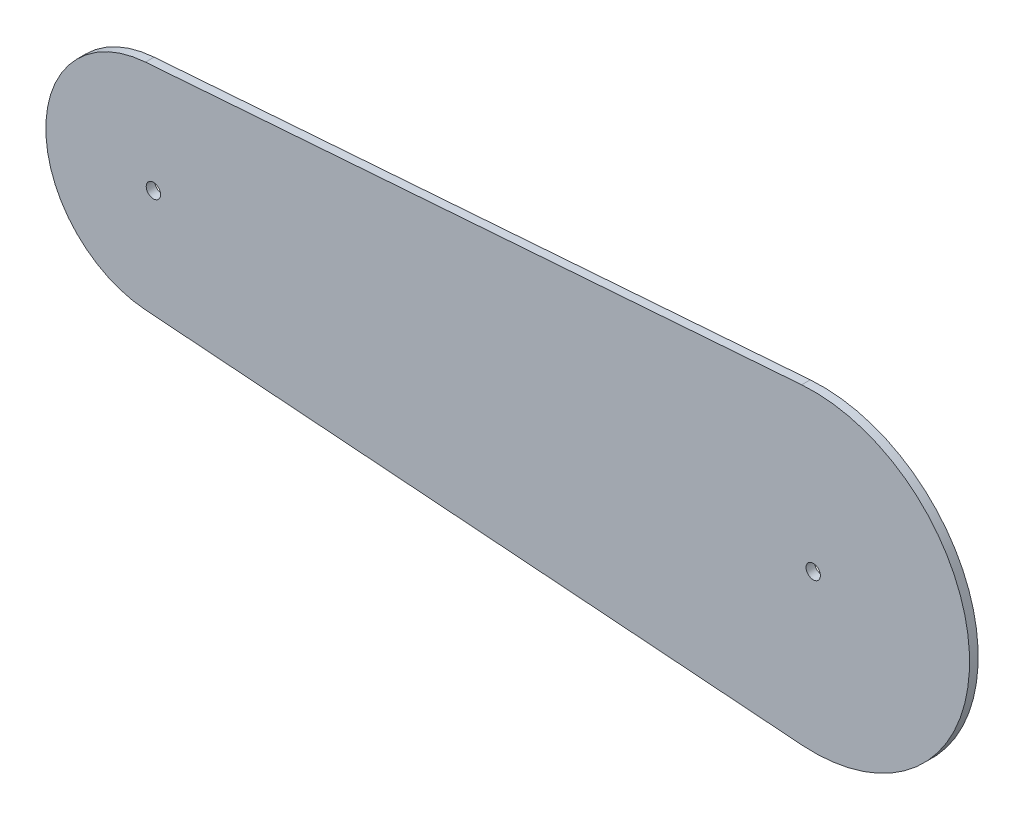
ISO-10303-21;
HEADER;
FILE_DESCRIPTION(('STEP AP214'),'2;1');
FILE_NAME('part.step','',(''),(''),'','','');
FILE_SCHEMA(('AUTOMOTIVE_DESIGN { 1 0 10303 214 1 1 1 1 }'));
ENDSEC;
DATA;
#1=APPLICATION_CONTEXT('core data for automotive mechanical design processes');
#2=APPLICATION_PROTOCOL_DEFINITION('international standard','automotive_design',2000,#1);
#3=PRODUCT_CONTEXT('',#1,'mechanical');
#4=PRODUCT('Part','Part','',(#3));
#5=PRODUCT_RELATED_PRODUCT_CATEGORY('part','',(#4));
#6=PRODUCT_DEFINITION_FORMATION('','',#4);
#7=PRODUCT_DEFINITION_CONTEXT('part definition',#1,'design');
#8=PRODUCT_DEFINITION('design','',#6,#7);
#9=PRODUCT_DEFINITION_SHAPE('','',#8);
#10=(LENGTH_UNIT() NAMED_UNIT(*) SI_UNIT(.MILLI.,.METRE.));
#11=(NAMED_UNIT(*) PLANE_ANGLE_UNIT() SI_UNIT($,.RADIAN.));
#12=(NAMED_UNIT(*) SI_UNIT($,.STERADIAN.) SOLID_ANGLE_UNIT());
#13=UNCERTAINTY_MEASURE_WITH_UNIT(LENGTH_MEASURE(1.E-05),#10,'distance_accuracy_value','');
#14=(GEOMETRIC_REPRESENTATION_CONTEXT(3) GLOBAL_UNCERTAINTY_ASSIGNED_CONTEXT((#13)) GLOBAL_UNIT_ASSIGNED_CONTEXT((#10,
#11,#12)) REPRESENTATION_CONTEXT('',''));
#15=CARTESIAN_POINT('',(0.,0.,0.));
#16=DIRECTION('',(0.,0.,1.));
#17=DIRECTION('',(1.,0.,0.));
#18=AXIS2_PLACEMENT_3D('',#15,#16,#17);
#19=CARTESIAN_POINT('',(0.,0.,3.));
#20=DIRECTION('',(0.,0.,-1.));
#21=DIRECTION('',(-1.,0.,0.));
#22=AXIS2_PLACEMENT_3D('',#19,#20,#21);
#23=CYLINDRICAL_SURFACE('',#22,37.5);
#24=CARTESIAN_POINT('',(0.,0.,0.));
#25=DIRECTION('',(0.,0.,1.));
#26=DIRECTION('',(1.,0.,0.));
#27=AXIS2_PLACEMENT_3D('',#24,#25,#26);
#28=CIRCLE('',#27,37.5);
#29=CARTESIAN_POINT('',(-2.77173913043479,37.3974258765602,0.));
#30=VERTEX_POINT('',#29);
#31=CARTESIAN_POINT('',(-2.77173913043478,-37.3974258765603,0.));
#32=VERTEX_POINT('',#31);
#33=EDGE_CURVE('E107',#30,#32,#28,.T.);
#34=ORIENTED_EDGE('',*,*,#33,.T.);
#35=DIRECTION('',(0.,0.,-1.));
#36=VECTOR('',#35,1.);
#37=CARTESIAN_POINT('',(-2.77173913043478,-37.3974258765603,3.));
#38=LINE('',#37,#36);
#39=CARTESIAN_POINT('',(-2.77173913043478,-37.3974258765603,3.));
#40=VERTEX_POINT('',#39);
#41=EDGE_CURVE('E11',#40,#32,#38,.T.);
#42=ORIENTED_EDGE('',*,*,#41,.F.);
#43=CARTESIAN_POINT('',(0.,0.,3.));
#44=DIRECTION('',(0.,0.,1.));
#45=DIRECTION('',(1.,0.,0.));
#46=AXIS2_PLACEMENT_3D('',#43,#44,#45);
#47=CIRCLE('',#46,37.5);
#48=CARTESIAN_POINT('',(-2.77173913043479,37.3974258765602,3.));
#49=VERTEX_POINT('',#48);
#50=EDGE_CURVE('E87',#49,#40,#47,.T.);
#51=ORIENTED_EDGE('',*,*,#50,.F.);
#52=DIRECTION('',(0.,0.,-1.));
#53=VECTOR('',#52,1.);
#54=CARTESIAN_POINT('',(-2.77173913043479,37.3974258765602,3.));
#55=LINE('',#54,#53);
#56=EDGE_CURVE('E53',#49,#30,#55,.T.);
#57=ORIENTED_EDGE('',*,*,#56,.T.);
#58=EDGE_LOOP('',(#34,#42,#51,#57));
#59=FACE_BOUND('',#58,.T.);
#60=ADVANCED_FACE('F36',(#59),#23,.T.);
#61=CARTESIAN_POINT('',(-2.77173913043478,-37.3974258765603,3.));
#62=DIRECTION('',(0.0739130434782608,0.997264690041606,0.));
#63=DIRECTION('',(-0.997264690041606,0.0739130434782608,0.));
#64=AXIS2_PLACEMENT_3D('',#61,#62,#63);
#65=PLANE('',#64);
#66=DIRECTION('',(0.997264690041606,-0.0739130434782608,0.));
#67=VECTOR('',#66,1.);
#68=CARTESIAN_POINT('',(-2.77173913043478,-37.3974258765603,0.));
#69=LINE('',#68,#67);
#70=CARTESIAN_POINT('',(225.971739130435,-54.3509256072675,0.));
#71=VERTEX_POINT('',#70);
#72=EDGE_CURVE('E92',#32,#71,#69,.T.);
#73=ORIENTED_EDGE('',*,*,#72,.T.);
#74=DIRECTION('',(0.,0.,-1.));
#75=VECTOR('',#74,1.);
#76=CARTESIAN_POINT('',(225.971739130435,-54.3509256072675,3.));
#77=LINE('',#76,#75);
#78=CARTESIAN_POINT('',(225.971739130435,-54.3509256072675,3.));
#79=VERTEX_POINT('',#78);
#80=EDGE_CURVE('E45',#79,#71,#77,.T.);
#81=ORIENTED_EDGE('',*,*,#80,.F.);
#82=DIRECTION('',(0.997264690041606,-0.0739130434782608,0.));
#83=VECTOR('',#82,1.);
#84=CARTESIAN_POINT('',(-2.77173913043478,-37.3974258765603,3.));
#85=LINE('',#84,#83);
#86=EDGE_CURVE('E79',#40,#79,#85,.T.);
#87=ORIENTED_EDGE('',*,*,#86,.F.);
#88=ORIENTED_EDGE('',*,*,#41,.T.);
#89=EDGE_LOOP('',(#73,#81,#87,#88));
#90=FACE_BOUND('',#89,.T.);
#91=ADVANCED_FACE('F91',(#90),#65,.F.);
#92=CARTESIAN_POINT('',(230.,0.,3.));
#93=DIRECTION('',(0.,0.,-1.));
#94=DIRECTION('',(-1.,0.,0.));
#95=AXIS2_PLACEMENT_3D('',#92,#93,#94);
#96=CYLINDRICAL_SURFACE('',#95,54.5);
#97=CARTESIAN_POINT('',(230.,0.,0.));
#98=DIRECTION('',(0.,0.,1.));
#99=DIRECTION('',(1.,0.,0.));
#100=AXIS2_PLACEMENT_3D('',#97,#98,#99);
#101=CIRCLE('',#100,54.5);
#102=CARTESIAN_POINT('',(225.971739130435,54.3509256072675,0.));
#103=VERTEX_POINT('',#102);
#104=EDGE_CURVE('E110',#71,#103,#101,.T.);
#105=ORIENTED_EDGE('',*,*,#104,.T.);
#106=DIRECTION('',(0.,0.,-1.));
#107=VECTOR('',#106,1.);
#108=CARTESIAN_POINT('',(225.971739130435,54.3509256072675,3.));
#109=LINE('',#108,#107);
#110=CARTESIAN_POINT('',(225.971739130435,54.3509256072675,3.));
#111=VERTEX_POINT('',#110);
#112=EDGE_CURVE('E68',#111,#103,#109,.T.);
#113=ORIENTED_EDGE('',*,*,#112,.F.);
#114=CARTESIAN_POINT('',(230.,0.,3.));
#115=DIRECTION('',(0.,0.,1.));
#116=DIRECTION('',(1.,0.,0.));
#117=AXIS2_PLACEMENT_3D('',#114,#115,#116);
#118=CIRCLE('',#117,54.5);
#119=EDGE_CURVE('E86',#79,#111,#118,.T.);
#120=ORIENTED_EDGE('',*,*,#119,.F.);
#121=ORIENTED_EDGE('',*,*,#80,.T.);
#122=EDGE_LOOP('',(#105,#113,#120,#121));
#123=FACE_BOUND('',#122,.T.);
#124=ADVANCED_FACE('F95',(#123),#96,.T.);
#125=CARTESIAN_POINT('',(-2.77173913043479,37.3974258765602,3.));
#126=DIRECTION('',(-0.0739130434782609,0.997264690041606,0.));
#127=DIRECTION('',(-0.997264690041606,-0.0739130434782609,0.));
#128=AXIS2_PLACEMENT_3D('',#125,#126,#127);
#129=PLANE('',#128);
#130=DIRECTION('',(0.997264690041606,0.0739130434782609,0.));
#131=VECTOR('',#130,1.);
#132=CARTESIAN_POINT('',(-2.77173913043479,37.3974258765602,0.));
#133=LINE('',#132,#131);
#134=EDGE_CURVE('E112',#30,#103,#133,.T.);
#135=ORIENTED_EDGE('',*,*,#134,.F.);
#136=ORIENTED_EDGE('',*,*,#56,.F.);
#137=DIRECTION('',(0.997264690041606,0.0739130434782609,0.));
#138=VECTOR('',#137,1.);
#139=CARTESIAN_POINT('',(-2.77173913043479,37.3974258765602,3.));
#140=LINE('',#139,#138);
#141=EDGE_CURVE('E96',#49,#111,#140,.T.);
#142=ORIENTED_EDGE('',*,*,#141,.T.);
#143=ORIENTED_EDGE('',*,*,#112,.T.);
#144=EDGE_LOOP('',(#135,#136,#142,#143));
#145=FACE_BOUND('',#144,.T.);
#146=ADVANCED_FACE('F148',(#145),#129,.T.);
#147=CARTESIAN_POINT('',(0.,0.,3.));
#148=DIRECTION('',(0.,0.,-1.));
#149=DIRECTION('',(-1.,0.,0.));
#150=AXIS2_PLACEMENT_3D('',#147,#148,#149);
#151=CYLINDRICAL_SURFACE('',#150,2.5);
#152=CARTESIAN_POINT('',(0.,0.,3.));
#153=DIRECTION('',(0.,0.,1.));
#154=DIRECTION('',(1.,0.,0.));
#155=AXIS2_PLACEMENT_3D('',#152,#153,#154);
#156=CIRCLE('',#155,2.5);
#157=CARTESIAN_POINT('',(2.5,0.,3.));
#158=VERTEX_POINT('',#157);
#159=EDGE_CURVE('E118',#158,#158,#156,.T.);
#160=ORIENTED_EDGE('',*,*,#159,.T.);
#161=EDGE_LOOP('',(#160));
#162=FACE_BOUND('',#161,.T.);
#163=CARTESIAN_POINT('',(0.,0.,0.));
#164=DIRECTION('',(0.,0.,1.));
#165=DIRECTION('',(1.,0.,0.));
#166=AXIS2_PLACEMENT_3D('',#163,#164,#165);
#167=CIRCLE('',#166,2.5);
#168=CARTESIAN_POINT('',(2.5,0.,0.));
#169=VERTEX_POINT('',#168);
#170=EDGE_CURVE('E104',#169,#169,#167,.T.);
#171=ORIENTED_EDGE('',*,*,#170,.F.);
#172=EDGE_LOOP('',(#171));
#173=FACE_BOUND('',#172,.T.);
#174=ADVANCED_FACE('F38',(#162,#173),#151,.F.);
#175=CARTESIAN_POINT('',(230.,0.,3.));
#176=DIRECTION('',(0.,0.,-1.));
#177=DIRECTION('',(-1.,0.,0.));
#178=AXIS2_PLACEMENT_3D('',#175,#176,#177);
#179=CYLINDRICAL_SURFACE('',#178,2.5);
#180=CARTESIAN_POINT('',(230.,0.,3.));
#181=DIRECTION('',(0.,0.,1.));
#182=DIRECTION('',(1.,0.,0.));
#183=AXIS2_PLACEMENT_3D('',#180,#181,#182);
#184=CIRCLE('',#183,2.5);
#185=CARTESIAN_POINT('',(232.5,0.,3.));
#186=VERTEX_POINT('',#185);
#187=EDGE_CURVE('E98',#186,#186,#184,.T.);
#188=ORIENTED_EDGE('',*,*,#187,.T.);
#189=EDGE_LOOP('',(#188));
#190=FACE_BOUND('',#189,.T.);
#191=CARTESIAN_POINT('',(230.,0.,0.));
#192=DIRECTION('',(0.,0.,1.));
#193=DIRECTION('',(1.,0.,0.));
#194=AXIS2_PLACEMENT_3D('',#191,#192,#193);
#195=CIRCLE('',#194,2.5);
#196=CARTESIAN_POINT('',(232.5,0.,0.));
#197=VERTEX_POINT('',#196);
#198=EDGE_CURVE('E115',#197,#197,#195,.T.);
#199=ORIENTED_EDGE('',*,*,#198,.F.);
#200=EDGE_LOOP('',(#199));
#201=FACE_BOUND('',#200,.T.);
#202=ADVANCED_FACE('F130',(#190,#201),#179,.F.);
#203=CARTESIAN_POINT('',(0.,0.,3.));
#204=DIRECTION('',(0.,0.,1.));
#205=DIRECTION('',(1.,0.,0.));
#206=AXIS2_PLACEMENT_3D('',#203,#204,#205);
#207=PLANE('',#206);
#208=ORIENTED_EDGE('',*,*,#159,.F.);
#209=EDGE_LOOP('',(#208));
#210=FACE_BOUND('',#209,.T.);
#211=ORIENTED_EDGE('',*,*,#50,.T.);
#212=ORIENTED_EDGE('',*,*,#86,.T.);
#213=ORIENTED_EDGE('',*,*,#119,.T.);
#214=ORIENTED_EDGE('',*,*,#141,.F.);
#215=EDGE_LOOP('',(#211,#212,#213,#214));
#216=FACE_BOUND('',#215,.T.);
#217=ORIENTED_EDGE('',*,*,#187,.F.);
#218=EDGE_LOOP('',(#217));
#219=FACE_BOUND('',#218,.T.);
#220=ADVANCED_FACE('F82',(#210,#216,#219),#207,.T.);
#221=CARTESIAN_POINT('',(0.,0.,0.));
#222=DIRECTION('',(0.,0.,1.));
#223=DIRECTION('',(1.,0.,0.));
#224=AXIS2_PLACEMENT_3D('',#221,#222,#223);
#225=PLANE('',#224);
#226=ORIENTED_EDGE('',*,*,#170,.T.);
#227=EDGE_LOOP('',(#226));
#228=FACE_BOUND('',#227,.T.);
#229=ORIENTED_EDGE('',*,*,#33,.F.);
#230=ORIENTED_EDGE('',*,*,#134,.T.);
#231=ORIENTED_EDGE('',*,*,#104,.F.);
#232=ORIENTED_EDGE('',*,*,#72,.F.);
#233=EDGE_LOOP('',(#229,#230,#231,#232));
#234=FACE_BOUND('',#233,.T.);
#235=ORIENTED_EDGE('',*,*,#198,.T.);
#236=EDGE_LOOP('',(#235));
#237=FACE_BOUND('',#236,.T.);
#238=ADVANCED_FACE('F129',(#228,#234,#237),#225,.F.);
#239=CLOSED_SHELL('',(#60,#91,#124,#146,#174,#202,#220,#238));
#240=MANIFOLD_SOLID_BREP('B2',#239);
#241=ADVANCED_BREP_SHAPE_REPRESENTATION('',(#18,#240),#14);
#242=SHAPE_DEFINITION_REPRESENTATION(#9,#241);
ENDSEC;
END-ISO-10303-21;
